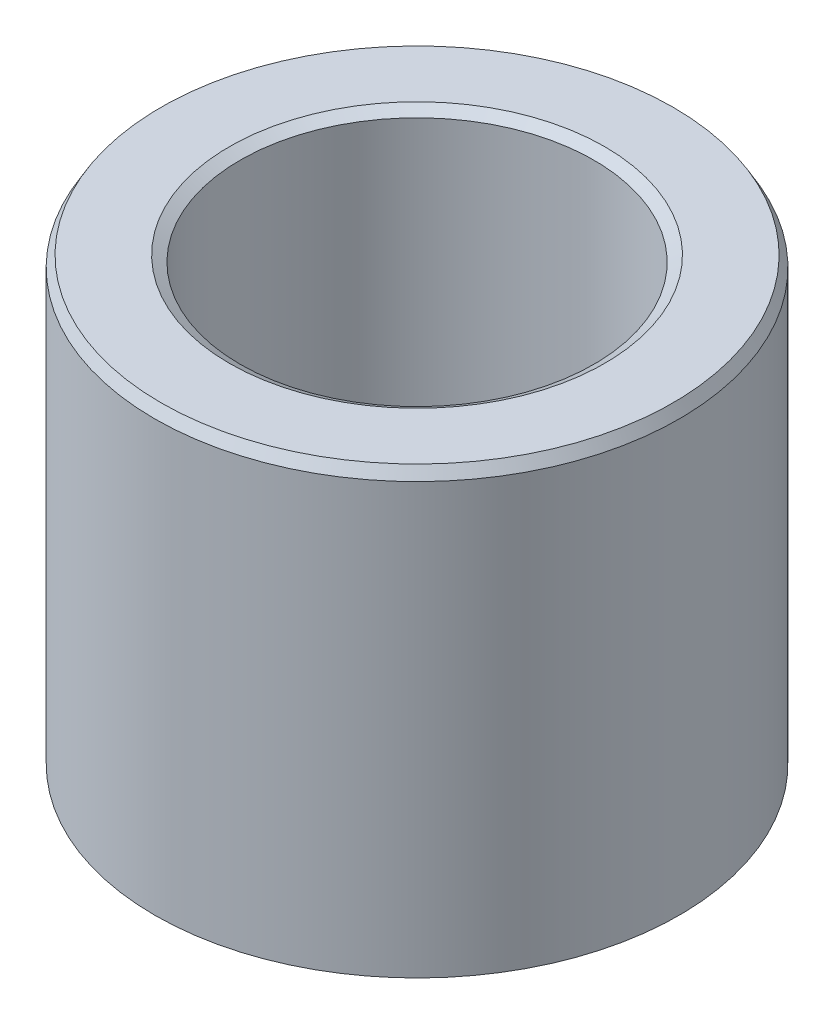
ISO-10303-21;
HEADER;
FILE_DESCRIPTION(('STEP AP214'),'2;1');
FILE_NAME('part.step','',(''),(''),'','','');
FILE_SCHEMA(('AUTOMOTIVE_DESIGN { 1 0 10303 214 1 1 1 1 }'));
ENDSEC;
DATA;
#1=APPLICATION_CONTEXT('core data for automotive mechanical design processes');
#2=APPLICATION_PROTOCOL_DEFINITION('international standard','automotive_design',2000,#1);
#3=PRODUCT_CONTEXT('',#1,'mechanical');
#4=PRODUCT('Part','Part','',(#3));
#5=PRODUCT_RELATED_PRODUCT_CATEGORY('part','',(#4));
#6=PRODUCT_DEFINITION_FORMATION('','',#4);
#7=PRODUCT_DEFINITION_CONTEXT('part definition',#1,'design');
#8=PRODUCT_DEFINITION('design','',#6,#7);
#9=PRODUCT_DEFINITION_SHAPE('','',#8);
#10=(LENGTH_UNIT() NAMED_UNIT(*) SI_UNIT(.MILLI.,.METRE.));
#11=(NAMED_UNIT(*) PLANE_ANGLE_UNIT() SI_UNIT($,.RADIAN.));
#12=(NAMED_UNIT(*) SI_UNIT($,.STERADIAN.) SOLID_ANGLE_UNIT());
#13=UNCERTAINTY_MEASURE_WITH_UNIT(LENGTH_MEASURE(1.E-05),#10,'distance_accuracy_value','');
#14=(GEOMETRIC_REPRESENTATION_CONTEXT(3) GLOBAL_UNCERTAINTY_ASSIGNED_CONTEXT((#13)) GLOBAL_UNIT_ASSIGNED_CONTEXT((#10,
#11,#12)) REPRESENTATION_CONTEXT('',''));
#15=CARTESIAN_POINT('',(0.,0.,0.));
#16=DIRECTION('',(0.,0.,1.));
#17=DIRECTION('',(1.,0.,0.));
#18=AXIS2_PLACEMENT_3D('',#15,#16,#17);
#19=CARTESIAN_POINT('',(0.,80.9451407171403,0.));
#20=DIRECTION('',(0.,-1.,0.));
#21=DIRECTION('',(0.,0.,-1.));
#22=AXIS2_PLACEMENT_3D('',#19,#20,#21);
#23=CYLINDRICAL_SURFACE('',#22,47.5);
#24=CARTESIAN_POINT('',(0.,1.13058094712404,0.));
#25=DIRECTION('',(0.,1.,0.));
#26=DIRECTION('',(0.,0.,1.));
#27=AXIS2_PLACEMENT_3D('',#24,#25,#26);
#28=CIRCLE('',#27,47.5);
#29=CARTESIAN_POINT('',(0.,1.13058094712404,47.5));
#30=VERTEX_POINT('',#29);
#31=EDGE_CURVE('E10',#30,#30,#28,.T.);
#32=ORIENTED_EDGE('',*,*,#31,.T.);
#33=EDGE_LOOP('',(#32));
#34=FACE_BOUND('',#33,.T.);
#35=CARTESIAN_POINT('',(0.,78.9869170746521,0.));
#36=DIRECTION('',(0.,1.,0.));
#37=DIRECTION('',(0.,0.,1.));
#38=AXIS2_PLACEMENT_3D('',#35,#36,#37);
#39=CIRCLE('',#38,47.5);
#40=CARTESIAN_POINT('',(0.,78.9869170746521,47.5));
#41=VERTEX_POINT('',#40);
#42=EDGE_CURVE('E50',#41,#41,#39,.F.);
#43=ORIENTED_EDGE('',*,*,#42,.T.);
#44=EDGE_LOOP('',(#43));
#45=FACE_BOUND('',#44,.T.);
#46=ADVANCED_FACE('F39',(#34,#45),#23,.T.);
#47=CARTESIAN_POINT('',(0.,80.9451407171403,0.));
#48=DIRECTION('',(0.,1.,0.));
#49=DIRECTION('',(0.,0.,1.));
#50=AXIS2_PLACEMENT_3D('',#47,#48,#49);
#51=PLANE('',#50);
#52=CARTESIAN_POINT('',(0.,80.9451407171403,0.));
#53=DIRECTION('',(0.,1.,0.));
#54=DIRECTION('',(0.,0.,1.));
#55=AXIS2_PLACEMENT_3D('',#52,#53,#54);
#56=CIRCLE('',#55,33.994626038501);
#57=CARTESIAN_POINT('',(0.,80.9451407171403,33.994626038501));
#58=VERTEX_POINT('',#57);
#59=EDGE_CURVE('E58',#58,#58,#56,.F.);
#60=ORIENTED_EDGE('',*,*,#59,.T.);
#61=EDGE_LOOP('',(#60));
#62=FACE_BOUND('',#61,.T.);
#63=CARTESIAN_POINT('',(0.,80.9451407171403,0.));
#64=DIRECTION('',(0.,1.,0.));
#65=DIRECTION('',(0.,0.,1.));
#66=AXIS2_PLACEMENT_3D('',#63,#64,#65);
#67=CIRCLE('',#66,46.369419052876);
#68=CARTESIAN_POINT('',(0.,80.9451407171403,46.369419052876));
#69=VERTEX_POINT('',#68);
#70=EDGE_CURVE('E61',#69,#69,#67,.T.);
#71=ORIENTED_EDGE('',*,*,#70,.T.);
#72=EDGE_LOOP('',(#71));
#73=FACE_BOUND('',#72,.T.);
#74=ADVANCED_FACE('F88',(#62,#73),#51,.T.);
#75=CARTESIAN_POINT('',(0.,0.,0.));
#76=DIRECTION('',(0.,1.,0.));
#77=DIRECTION('',(0.,0.,1.));
#78=AXIS2_PLACEMENT_3D('',#75,#76,#77);
#79=PLANE('',#78);
#80=CARTESIAN_POINT('',(0.,0.,0.));
#81=DIRECTION('',(0.,1.,0.));
#82=DIRECTION('',(0.,0.,1.));
#83=AXIS2_PLACEMENT_3D('',#80,#81,#82);
#84=CIRCLE('',#83,33.1669833431368);
#85=CARTESIAN_POINT('',(0.,0.,33.1669833431368));
#86=VERTEX_POINT('',#85);
#87=EDGE_CURVE('E51',#86,#86,#84,.T.);
#88=ORIENTED_EDGE('',*,*,#87,.T.);
#89=EDGE_LOOP('',(#88));
#90=FACE_BOUND('',#89,.T.);
#91=CARTESIAN_POINT('',(0.,0.,0.));
#92=DIRECTION('',(0.,1.,0.));
#93=DIRECTION('',(0.,0.,1.));
#94=AXIS2_PLACEMENT_3D('',#91,#92,#93);
#95=CIRCLE('',#94,45.5417763575118);
#96=CARTESIAN_POINT('',(0.,0.,45.5417763575118));
#97=VERTEX_POINT('',#96);
#98=EDGE_CURVE('E54',#97,#97,#95,.F.);
#99=ORIENTED_EDGE('',*,*,#98,.T.);
#100=EDGE_LOOP('',(#99));
#101=FACE_BOUND('',#100,.T.);
#102=ADVANCED_FACE('F83',(#90,#101),#79,.F.);
#103=CARTESIAN_POINT('',(0.,80.9451407171403,0.));
#104=DIRECTION('',(0.,-1.,0.));
#105=DIRECTION('',(0.,0.,-1.));
#106=AXIS2_PLACEMENT_3D('',#103,#104,#105);
#107=CYLINDRICAL_SURFACE('',#106,32.0364023960128);
#108=CARTESIAN_POINT('',(0.,79.8145597700162,0.));
#109=DIRECTION('',(0.,1.,0.));
#110=DIRECTION('',(0.,0.,1.));
#111=AXIS2_PLACEMENT_3D('',#108,#109,#110);
#112=CIRCLE('',#111,32.0364023960128);
#113=CARTESIAN_POINT('',(0.,79.8145597700162,32.0364023960128));
#114=VERTEX_POINT('',#113);
#115=EDGE_CURVE('E67',#114,#114,#112,.T.);
#116=ORIENTED_EDGE('',*,*,#115,.T.);
#117=EDGE_LOOP('',(#116));
#118=FACE_BOUND('',#117,.T.);
#119=CARTESIAN_POINT('',(0.,1.9582236424882,0.));
#120=DIRECTION('',(0.,1.,0.));
#121=DIRECTION('',(0.,0.,1.));
#122=AXIS2_PLACEMENT_3D('',#119,#120,#121);
#123=CIRCLE('',#122,32.0364023960128);
#124=CARTESIAN_POINT('',(0.,1.9582236424882,32.0364023960128));
#125=VERTEX_POINT('',#124);
#126=EDGE_CURVE('E69',#125,#125,#123,.F.);
#127=ORIENTED_EDGE('',*,*,#126,.T.);
#128=EDGE_LOOP('',(#127));
#129=FACE_BOUND('',#128,.T.);
#130=ADVANCED_FACE('F71',(#118,#129),#107,.F.);
#131=CARTESIAN_POINT('',(0.,79.8145597700162,0.));
#132=DIRECTION('',(0.,1.,0.));
#133=DIRECTION('',(0.,0.,1.));
#134=AXIS2_PLACEMENT_3D('',#131,#132,#133);
#135=CONICAL_SURFACE('',#134,32.0364023960128,1.0471975511966);
#136=ORIENTED_EDGE('',*,*,#59,.F.);
#137=EDGE_LOOP('',(#136));
#138=FACE_BOUND('',#137,.T.);
#139=ORIENTED_EDGE('',*,*,#115,.F.);
#140=EDGE_LOOP('',(#139));
#141=FACE_BOUND('',#140,.T.);
#142=ADVANCED_FACE('F77',(#138,#141),#135,.F.);
#143=CARTESIAN_POINT('',(0.,0.,0.));
#144=DIRECTION('',(0.,-1.,0.));
#145=DIRECTION('',(0.,0.,-1.));
#146=AXIS2_PLACEMENT_3D('',#143,#144,#145);
#147=CONICAL_SURFACE('',#146,33.1669833431368,0.523598775598294);
#148=ORIENTED_EDGE('',*,*,#126,.F.);
#149=EDGE_LOOP('',(#148));
#150=FACE_BOUND('',#149,.T.);
#151=ORIENTED_EDGE('',*,*,#87,.F.);
#152=EDGE_LOOP('',(#151));
#153=FACE_BOUND('',#152,.T.);
#154=ADVANCED_FACE('F73',(#150,#153),#147,.F.);
#155=CARTESIAN_POINT('',(0.,1.13058094712404,0.));
#156=DIRECTION('',(0.,1.,0.));
#157=DIRECTION('',(0.,0.,1.));
#158=AXIS2_PLACEMENT_3D('',#155,#156,#157);
#159=CONICAL_SURFACE('',#158,47.5,1.04719755119659);
#160=ORIENTED_EDGE('',*,*,#98,.F.);
#161=EDGE_LOOP('',(#160));
#162=FACE_BOUND('',#161,.T.);
#163=ORIENTED_EDGE('',*,*,#31,.F.);
#164=EDGE_LOOP('',(#163));
#165=FACE_BOUND('',#164,.T.);
#166=ADVANCED_FACE('F76',(#162,#165),#159,.T.);
#167=CARTESIAN_POINT('',(0.,80.9451407171403,0.));
#168=DIRECTION('',(0.,-1.,0.));
#169=DIRECTION('',(0.,0.,-1.));
#170=AXIS2_PLACEMENT_3D('',#167,#168,#169);
#171=CONICAL_SURFACE('',#170,46.369419052876,0.523598775598292);
#172=ORIENTED_EDGE('',*,*,#42,.F.);
#173=EDGE_LOOP('',(#172));
#174=FACE_BOUND('',#173,.T.);
#175=ORIENTED_EDGE('',*,*,#70,.F.);
#176=EDGE_LOOP('',(#175));
#177=FACE_BOUND('',#176,.T.);
#178=ADVANCED_FACE('F45',(#174,#177),#171,.T.);
#179=CLOSED_SHELL('',(#46,#74,#102,#130,#142,#154,#166,#178));
#180=MANIFOLD_SOLID_BREP('B2',#179);
#181=ADVANCED_BREP_SHAPE_REPRESENTATION('',(#18,#180),#14);
#182=SHAPE_DEFINITION_REPRESENTATION(#9,#181);
ENDSEC;
END-ISO-10303-21;
